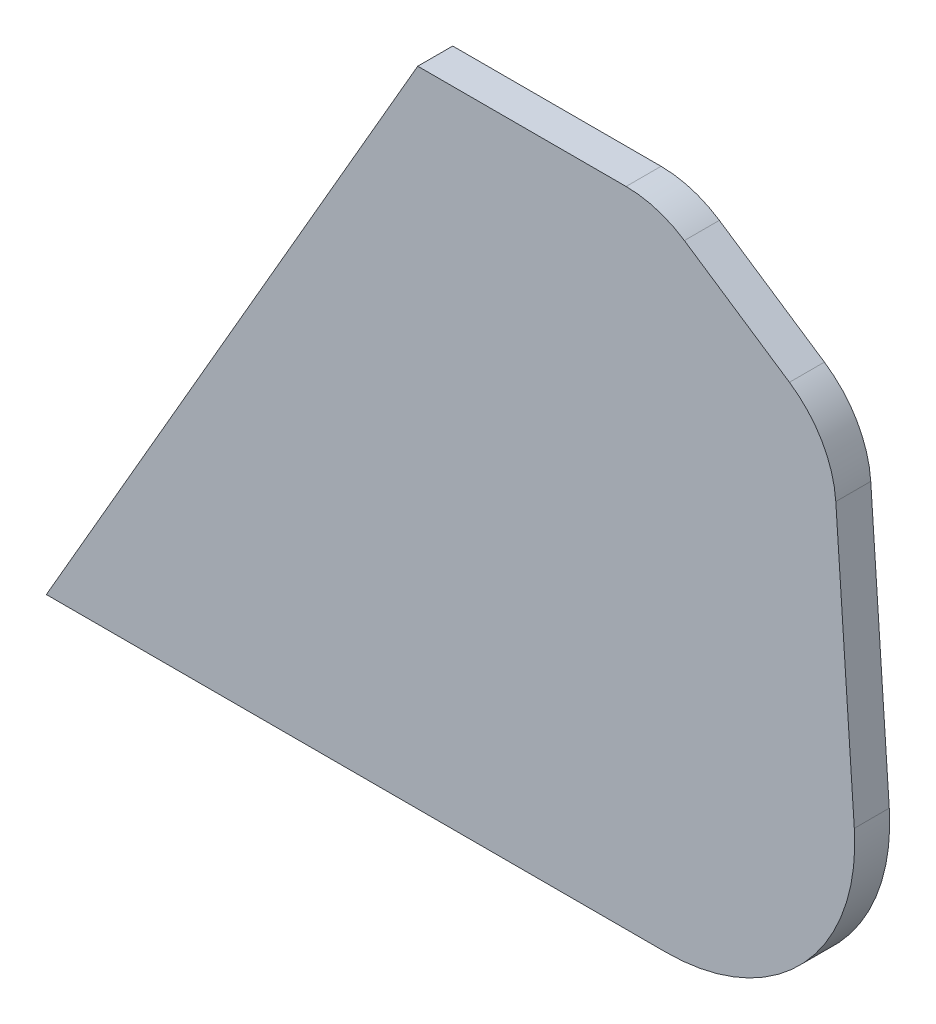
ISO-10303-21;
HEADER;
FILE_DESCRIPTION(('STEP AP214'),'2;1');
FILE_NAME('part.step','',(''),(''),'','','');
FILE_SCHEMA(('AUTOMOTIVE_DESIGN { 1 0 10303 214 1 1 1 1 }'));
ENDSEC;
DATA;
#1=APPLICATION_CONTEXT('core data for automotive mechanical design processes');
#2=APPLICATION_PROTOCOL_DEFINITION('international standard','automotive_design',2000,#1);
#3=PRODUCT_CONTEXT('',#1,'mechanical');
#4=PRODUCT('Part','Part','',(#3));
#5=PRODUCT_RELATED_PRODUCT_CATEGORY('part','',(#4));
#6=PRODUCT_DEFINITION_FORMATION('','',#4);
#7=PRODUCT_DEFINITION_CONTEXT('part definition',#1,'design');
#8=PRODUCT_DEFINITION('design','',#6,#7);
#9=PRODUCT_DEFINITION_SHAPE('','',#8);
#10=(LENGTH_UNIT() NAMED_UNIT(*) SI_UNIT(.MILLI.,.METRE.));
#11=(NAMED_UNIT(*) PLANE_ANGLE_UNIT() SI_UNIT($,.RADIAN.));
#12=(NAMED_UNIT(*) SI_UNIT($,.STERADIAN.) SOLID_ANGLE_UNIT());
#13=UNCERTAINTY_MEASURE_WITH_UNIT(LENGTH_MEASURE(1.E-05),#10,'distance_accuracy_value','');
#14=(GEOMETRIC_REPRESENTATION_CONTEXT(3) GLOBAL_UNCERTAINTY_ASSIGNED_CONTEXT((#13)) GLOBAL_UNIT_ASSIGNED_CONTEXT((#10,
#11,#12)) REPRESENTATION_CONTEXT('',''));
#15=CARTESIAN_POINT('',(0.,0.,0.));
#16=DIRECTION('',(0.,0.,1.));
#17=DIRECTION('',(1.,0.,0.));
#18=AXIS2_PLACEMENT_3D('',#15,#16,#17);
#19=CARTESIAN_POINT('',(83.6120320595749,27.,5.));
#20=DIRECTION('',(0.,0.,-1.));
#21=DIRECTION('',(-1.,0.,0.));
#22=AXIS2_PLACEMENT_3D('',#19,#20,#21);
#23=CYLINDRICAL_SURFACE('',#22,27.);
#24=CARTESIAN_POINT('',(83.6120320595749,27.,0.));
#25=DIRECTION('',(0.,0.,1.));
#26=DIRECTION('',(1.,0.,0.));
#27=AXIS2_PLACEMENT_3D('',#24,#25,#26);
#28=CIRCLE('',#27,27.);
#29=CARTESIAN_POINT('',(83.6120320595749,0.,0.));
#30=VERTEX_POINT('',#29);
#31=CARTESIAN_POINT('',(110.550478803952,28.8221105894969,0.));
#32=VERTEX_POINT('',#31);
#33=EDGE_CURVE('E132',#30,#32,#28,.T.);
#34=ORIENTED_EDGE('',*,*,#33,.T.);
#35=DIRECTION('',(0.,0.,-1.));
#36=VECTOR('',#35,1.);
#37=CARTESIAN_POINT('',(110.550478803952,28.8221105894969,5.));
#38=LINE('',#37,#36);
#39=CARTESIAN_POINT('',(110.550478803952,28.8221105894969,5.));
#40=VERTEX_POINT('',#39);
#41=EDGE_CURVE('E11',#40,#32,#38,.T.);
#42=ORIENTED_EDGE('',*,*,#41,.F.);
#43=CARTESIAN_POINT('',(83.6120320595749,27.,5.));
#44=DIRECTION('',(0.,0.,1.));
#45=DIRECTION('',(1.,0.,0.));
#46=AXIS2_PLACEMENT_3D('',#43,#44,#45);
#47=CIRCLE('',#46,27.);
#48=CARTESIAN_POINT('',(83.6120320595749,0.,5.));
#49=VERTEX_POINT('',#48);
#50=EDGE_CURVE('E151',#49,#40,#47,.T.);
#51=ORIENTED_EDGE('',*,*,#50,.F.);
#52=DIRECTION('',(0.,0.,-1.));
#53=VECTOR('',#52,1.);
#54=CARTESIAN_POINT('',(83.6120320595749,0.,5.));
#55=LINE('',#54,#53);
#56=EDGE_CURVE('E128',#49,#30,#55,.T.);
#57=ORIENTED_EDGE('',*,*,#56,.T.);
#58=EDGE_LOOP('',(#34,#42,#51,#57));
#59=FACE_BOUND('',#58,.T.);
#60=ADVANCED_FACE('F36',(#59),#23,.T.);
#61=CARTESIAN_POINT('',(110.550478803952,28.8221105894969,5.));
#62=DIRECTION('',(-0.997720249791746,-0.0674855773887729,0.));
#63=DIRECTION('',(0.0674855773887729,-0.997720249791746,0.));
#64=AXIS2_PLACEMENT_3D('',#61,#62,#63);
#65=PLANE('',#64);
#66=DIRECTION('',(-0.0674855773887729,0.997720249791746,0.));
#67=VECTOR('',#66,1.);
#68=CARTESIAN_POINT('',(110.550478803952,28.8221105894969,0.));
#69=LINE('',#68,#67);
#70=CARTESIAN_POINT('',(107.902603036962,67.9688345841679,0.));
#71=VERTEX_POINT('',#70);
#72=EDGE_CURVE('E135',#32,#71,#69,.T.);
#73=ORIENTED_EDGE('',*,*,#72,.T.);
#74=DIRECTION('',(0.,0.,-1.));
#75=VECTOR('',#74,1.);
#76=CARTESIAN_POINT('',(107.902603036962,67.9688345841679,5.));
#77=LINE('',#76,#75);
#78=CARTESIAN_POINT('',(107.902603036962,67.9688345841679,5.));
#79=VERTEX_POINT('',#78);
#80=EDGE_CURVE('E44',#79,#71,#77,.T.);
#81=ORIENTED_EDGE('',*,*,#80,.F.);
#82=DIRECTION('',(-0.0674855773887729,0.997720249791746,0.));
#83=VECTOR('',#82,1.);
#84=CARTESIAN_POINT('',(110.550478803952,28.8221105894969,5.));
#85=LINE('',#84,#83);
#86=EDGE_CURVE('E95',#40,#79,#85,.T.);
#87=ORIENTED_EDGE('',*,*,#86,.F.);
#88=ORIENTED_EDGE('',*,*,#41,.T.);
#89=EDGE_LOOP('',(#73,#81,#87,#88));
#90=FACE_BOUND('',#89,.T.);
#91=ADVANCED_FACE('F186',(#90),#65,.F.);
#92=CARTESIAN_POINT('',(92.9367992900853,66.9565509233363,5.));
#93=DIRECTION('',(0.,0.,-1.));
#94=DIRECTION('',(-1.,0.,0.));
#95=AXIS2_PLACEMENT_3D('',#92,#93,#94);
#96=CYLINDRICAL_SURFACE('',#95,15.);
#97=CARTESIAN_POINT('',(92.9367992900853,66.9565509233363,0.));
#98=DIRECTION('',(0.,0.,1.));
#99=DIRECTION('',(1.,0.,0.));
#100=AXIS2_PLACEMENT_3D('',#97,#98,#99);
#101=CIRCLE('',#100,15.);
#102=CARTESIAN_POINT('',(101.272859860447,79.4269195693412,0.));
#103=VERTEX_POINT('',#102);
#104=EDGE_CURVE('E138',#71,#103,#101,.T.);
#105=ORIENTED_EDGE('',*,*,#104,.T.);
#106=DIRECTION('',(0.,0.,-1.));
#107=VECTOR('',#106,1.);
#108=CARTESIAN_POINT('',(101.272859860447,79.4269195693412,5.));
#109=LINE('',#108,#107);
#110=CARTESIAN_POINT('',(101.272859860447,79.4269195693412,5.));
#111=VERTEX_POINT('',#110);
#112=EDGE_CURVE('E158',#111,#103,#109,.T.);
#113=ORIENTED_EDGE('',*,*,#112,.F.);
#114=CARTESIAN_POINT('',(92.9367992900853,66.9565509233363,5.));
#115=DIRECTION('',(0.,0.,1.));
#116=DIRECTION('',(1.,0.,0.));
#117=AXIS2_PLACEMENT_3D('',#114,#115,#116);
#118=CIRCLE('',#117,15.);
#119=EDGE_CURVE('E166',#79,#111,#118,.T.);
#120=ORIENTED_EDGE('',*,*,#119,.F.);
#121=ORIENTED_EDGE('',*,*,#80,.T.);
#122=EDGE_LOOP('',(#105,#113,#120,#121));
#123=FACE_BOUND('',#122,.T.);
#124=ADVANCED_FACE('F164',(#123),#96,.T.);
#125=CARTESIAN_POINT('',(101.272859860447,79.4269195693413,5.));
#126=DIRECTION('',(-0.55573737135744,-0.831357909733662,0.));
#127=DIRECTION('',(0.831357909733662,-0.55573737135744,0.));
#128=AXIS2_PLACEMENT_3D('',#125,#126,#127);
#129=PLANE('',#128);
#130=DIRECTION('',(-0.831357909733662,0.55573737135744,0.));
#131=VECTOR('',#130,1.);
#132=CARTESIAN_POINT('',(101.272859860447,79.4269195693413,0.));
#133=LINE('',#132,#131);
#134=CARTESIAN_POINT('',(86.2483154241124,89.4703686460049,0.));
#135=VERTEX_POINT('',#134);
#136=EDGE_CURVE('E141',#103,#135,#133,.T.);
#137=ORIENTED_EDGE('',*,*,#136,.T.);
#138=DIRECTION('',(0.,0.,-1.));
#139=VECTOR('',#138,1.);
#140=CARTESIAN_POINT('',(86.2483154241124,89.4703686460049,5.));
#141=LINE('',#140,#139);
#142=CARTESIAN_POINT('',(86.2483154241124,89.4703686460049,5.));
#143=VERTEX_POINT('',#142);
#144=EDGE_CURVE('E155',#143,#135,#141,.T.);
#145=ORIENTED_EDGE('',*,*,#144,.F.);
#146=DIRECTION('',(-0.831357909733662,0.55573737135744,0.));
#147=VECTOR('',#146,1.);
#148=CARTESIAN_POINT('',(101.272859860447,79.4269195693413,5.));
#149=LINE('',#148,#147);
#150=EDGE_CURVE('E178',#111,#143,#149,.T.);
#151=ORIENTED_EDGE('',*,*,#150,.F.);
#152=ORIENTED_EDGE('',*,*,#112,.T.);
#153=EDGE_LOOP('',(#137,#145,#151,#152));
#154=FACE_BOUND('',#153,.T.);
#155=ADVANCED_FACE('F174',(#154),#129,.F.);
#156=CARTESIAN_POINT('',(77.9122548537508,77.,5.));
#157=DIRECTION('',(0.,0.,-1.));
#158=DIRECTION('',(-1.,0.,0.));
#159=AXIS2_PLACEMENT_3D('',#156,#157,#158);
#160=CYLINDRICAL_SURFACE('',#159,15.);
#161=CARTESIAN_POINT('',(77.9122548537508,77.,0.));
#162=DIRECTION('',(0.,0.,1.));
#163=DIRECTION('',(1.,0.,0.));
#164=AXIS2_PLACEMENT_3D('',#161,#162,#163);
#165=CIRCLE('',#164,15.);
#166=CARTESIAN_POINT('',(77.9122548537508,92.,0.));
#167=VERTEX_POINT('',#166);
#168=EDGE_CURVE('E144',#135,#167,#165,.T.);
#169=ORIENTED_EDGE('',*,*,#168,.T.);
#170=DIRECTION('',(0.,0.,-1.));
#171=VECTOR('',#170,1.);
#172=CARTESIAN_POINT('',(77.9122548537508,92.,5.));
#173=LINE('',#172,#171);
#174=CARTESIAN_POINT('',(77.9122548537508,92.,5.));
#175=VERTEX_POINT('',#174);
#176=EDGE_CURVE('E123',#175,#167,#173,.T.);
#177=ORIENTED_EDGE('',*,*,#176,.F.);
#178=CARTESIAN_POINT('',(77.9122548537508,77.,5.));
#179=DIRECTION('',(0.,0.,1.));
#180=DIRECTION('',(1.,0.,0.));
#181=AXIS2_PLACEMENT_3D('',#178,#179,#180);
#182=CIRCLE('',#181,15.);
#183=EDGE_CURVE('E114',#143,#175,#182,.T.);
#184=ORIENTED_EDGE('',*,*,#183,.F.);
#185=ORIENTED_EDGE('',*,*,#144,.T.);
#186=EDGE_LOOP('',(#169,#177,#184,#185));
#187=FACE_BOUND('',#186,.T.);
#188=ADVANCED_FACE('F177',(#187),#160,.T.);
#189=CARTESIAN_POINT('',(77.9122548537508,92.,5.));
#190=DIRECTION('',(0.,-1.,0.));
#191=DIRECTION('',(0.,0.,-1.));
#192=AXIS2_PLACEMENT_3D('',#189,#190,#191);
#193=PLANE('',#192);
#194=DIRECTION('',(-1.,0.,0.));
#195=VECTOR('',#194,1.);
#196=CARTESIAN_POINT('',(77.9122548537508,92.,0.));
#197=LINE('',#196,#195);
#198=CARTESIAN_POINT('',(48.116224765446,92.,0.));
#199=VERTEX_POINT('',#198);
#200=EDGE_CURVE('E122',#167,#199,#197,.T.);
#201=ORIENTED_EDGE('',*,*,#200,.T.);
#202=DIRECTION('',(0.,0.,-1.));
#203=VECTOR('',#202,1.);
#204=CARTESIAN_POINT('',(48.116224765446,92.,5.));
#205=LINE('',#204,#203);
#206=CARTESIAN_POINT('',(48.116224765446,92.,5.));
#207=VERTEX_POINT('',#206);
#208=EDGE_CURVE('E119',#207,#199,#205,.T.);
#209=ORIENTED_EDGE('',*,*,#208,.F.);
#210=DIRECTION('',(-1.,0.,0.));
#211=VECTOR('',#210,1.);
#212=CARTESIAN_POINT('',(77.9122548537508,92.,5.));
#213=LINE('',#212,#211);
#214=EDGE_CURVE('E108',#175,#207,#213,.T.);
#215=ORIENTED_EDGE('',*,*,#214,.F.);
#216=ORIENTED_EDGE('',*,*,#176,.T.);
#217=EDGE_LOOP('',(#201,#209,#215,#216));
#218=FACE_BOUND('',#217,.T.);
#219=ADVANCED_FACE('F120',(#218),#193,.F.);
#220=CARTESIAN_POINT('',(48.116224765446,92.,5.));
#221=DIRECTION('',(0.866025403784437,-0.500000000000003,0.));
#222=DIRECTION('',(0.500000000000003,0.866025403784437,0.));
#223=AXIS2_PLACEMENT_3D('',#220,#221,#222);
#224=PLANE('',#223);
#225=DIRECTION('',(-0.500000000000003,-0.866025403784437,0.));
#226=VECTOR('',#225,1.);
#227=CARTESIAN_POINT('',(48.116224765446,92.,0.));
#228=LINE('',#227,#226);
#229=CARTESIAN_POINT('',(-4.99999999999999,0.,0.));
#230=VERTEX_POINT('',#229);
#231=EDGE_CURVE('E81',#199,#230,#228,.T.);
#232=ORIENTED_EDGE('',*,*,#231,.T.);
#233=DIRECTION('',(0.,0.,-1.));
#234=VECTOR('',#233,1.);
#235=CARTESIAN_POINT('',(-4.99999999999999,0.,5.));
#236=LINE('',#235,#234);
#237=CARTESIAN_POINT('',(-4.99999999999999,0.,5.));
#238=VERTEX_POINT('',#237);
#239=EDGE_CURVE('E124',#238,#230,#236,.T.);
#240=ORIENTED_EDGE('',*,*,#239,.F.);
#241=DIRECTION('',(-0.500000000000003,-0.866025403784437,0.));
#242=VECTOR('',#241,1.);
#243=CARTESIAN_POINT('',(48.116224765446,92.,5.));
#244=LINE('',#243,#242);
#245=EDGE_CURVE('E112',#207,#238,#244,.T.);
#246=ORIENTED_EDGE('',*,*,#245,.F.);
#247=ORIENTED_EDGE('',*,*,#208,.T.);
#248=EDGE_LOOP('',(#232,#240,#246,#247));
#249=FACE_BOUND('',#248,.T.);
#250=ADVANCED_FACE('F126',(#249),#224,.F.);
#251=CARTESIAN_POINT('',(-4.99999999999999,0.,5.));
#252=DIRECTION('',(0.,1.,0.));
#253=DIRECTION('',(-1.,0.,0.));
#254=AXIS2_PLACEMENT_3D('',#251,#252,#253);
#255=PLANE('',#254);
#256=DIRECTION('',(1.,0.,0.));
#257=VECTOR('',#256,1.);
#258=CARTESIAN_POINT('',(-4.99999999999999,0.,0.));
#259=LINE('',#258,#257);
#260=EDGE_CURVE('E87',#230,#30,#259,.T.);
#261=ORIENTED_EDGE('',*,*,#260,.T.);
#262=ORIENTED_EDGE('',*,*,#56,.F.);
#263=DIRECTION('',(1.,0.,0.));
#264=VECTOR('',#263,1.);
#265=CARTESIAN_POINT('',(-4.99999999999999,0.,5.));
#266=LINE('',#265,#264);
#267=EDGE_CURVE('E52',#238,#49,#266,.T.);
#268=ORIENTED_EDGE('',*,*,#267,.F.);
#269=ORIENTED_EDGE('',*,*,#239,.T.);
#270=EDGE_LOOP('',(#261,#262,#268,#269));
#271=FACE_BOUND('',#270,.T.);
#272=ADVANCED_FACE('F202',(#271),#255,.F.);
#273=CARTESIAN_POINT('',(83.6120320595749,27.,5.));
#274=DIRECTION('',(0.,0.,1.));
#275=DIRECTION('',(1.,0.,0.));
#276=AXIS2_PLACEMENT_3D('',#273,#274,#275);
#277=PLANE('',#276);
#278=ORIENTED_EDGE('',*,*,#50,.T.);
#279=ORIENTED_EDGE('',*,*,#86,.T.);
#280=ORIENTED_EDGE('',*,*,#119,.T.);
#281=ORIENTED_EDGE('',*,*,#150,.T.);
#282=ORIENTED_EDGE('',*,*,#183,.T.);
#283=ORIENTED_EDGE('',*,*,#214,.T.);
#284=ORIENTED_EDGE('',*,*,#245,.T.);
#285=ORIENTED_EDGE('',*,*,#267,.T.);
#286=EDGE_LOOP('',(#278,#279,#280,#281,#282,#283,#284,#285));
#287=FACE_BOUND('',#286,.T.);
#288=ADVANCED_FACE('F110',(#287),#277,.T.);
#289=CARTESIAN_POINT('',(83.6120320595749,27.,0.));
#290=DIRECTION('',(0.,0.,1.));
#291=DIRECTION('',(1.,0.,0.));
#292=AXIS2_PLACEMENT_3D('',#289,#290,#291);
#293=PLANE('',#292);
#294=ORIENTED_EDGE('',*,*,#33,.F.);
#295=ORIENTED_EDGE('',*,*,#260,.F.);
#296=ORIENTED_EDGE('',*,*,#231,.F.);
#297=ORIENTED_EDGE('',*,*,#200,.F.);
#298=ORIENTED_EDGE('',*,*,#168,.F.);
#299=ORIENTED_EDGE('',*,*,#136,.F.);
#300=ORIENTED_EDGE('',*,*,#104,.F.);
#301=ORIENTED_EDGE('',*,*,#72,.F.);
#302=EDGE_LOOP('',(#294,#295,#296,#297,#298,#299,#300,#301));
#303=FACE_BOUND('',#302,.T.);
#304=ADVANCED_FACE('F170',(#303),#293,.F.);
#305=CLOSED_SHELL('',(#60,#91,#124,#155,#188,#219,#250,#272,#288,#304));
#306=MANIFOLD_SOLID_BREP('B2',#305);
#307=ADVANCED_BREP_SHAPE_REPRESENTATION('',(#18,#306),#14);
#308=SHAPE_DEFINITION_REPRESENTATION(#9,#307);
ENDSEC;
END-ISO-10303-21;
